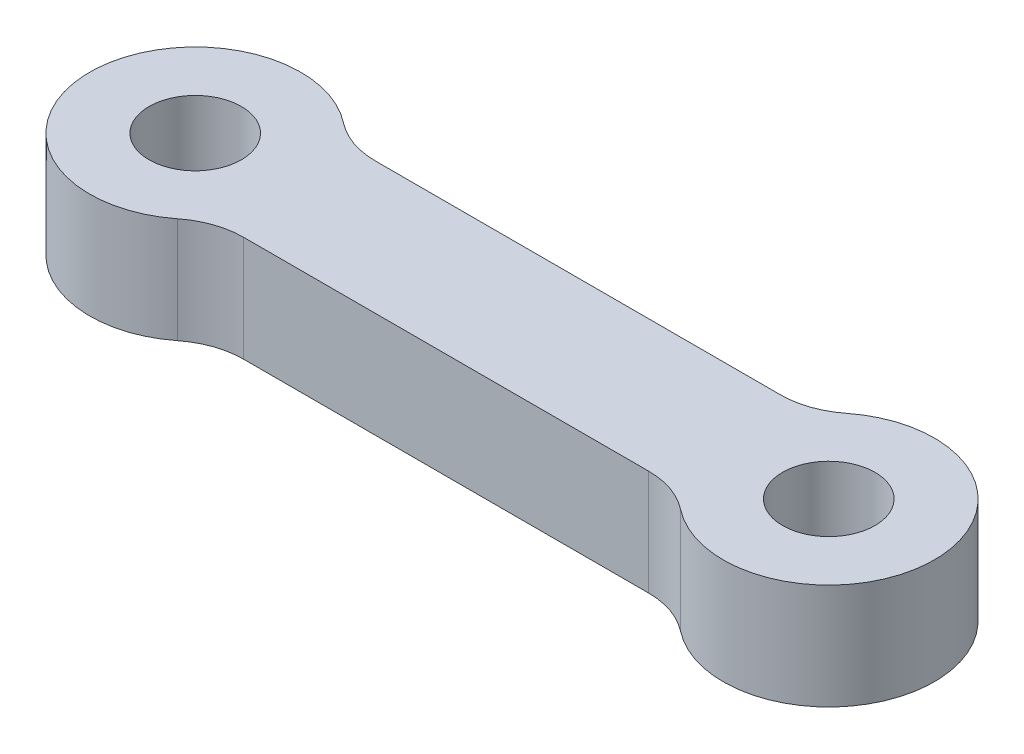
ISO-10303-21;
HEADER;
FILE_DESCRIPTION(('STEP AP214'),'2;1');
FILE_NAME('part.step','',(''),(''),'','','');
FILE_SCHEMA(('AUTOMOTIVE_DESIGN { 1 0 10303 214 1 1 1 1 }'));
ENDSEC;
DATA;
#1=APPLICATION_CONTEXT('core data for automotive mechanical design processes');
#2=APPLICATION_PROTOCOL_DEFINITION('international standard','automotive_design',2000,#1);
#3=PRODUCT_CONTEXT('',#1,'mechanical');
#4=PRODUCT('Part','Part','',(#3));
#5=PRODUCT_RELATED_PRODUCT_CATEGORY('part','',(#4));
#6=PRODUCT_DEFINITION_FORMATION('','',#4);
#7=PRODUCT_DEFINITION_CONTEXT('part definition',#1,'design');
#8=PRODUCT_DEFINITION('design','',#6,#7);
#9=PRODUCT_DEFINITION_SHAPE('','',#8);
#10=(LENGTH_UNIT() NAMED_UNIT(*) SI_UNIT(.MILLI.,.METRE.));
#11=(NAMED_UNIT(*) PLANE_ANGLE_UNIT() SI_UNIT($,.RADIAN.));
#12=(NAMED_UNIT(*) SI_UNIT($,.STERADIAN.) SOLID_ANGLE_UNIT());
#13=UNCERTAINTY_MEASURE_WITH_UNIT(LENGTH_MEASURE(1.E-05),#10,'distance_accuracy_value','');
#14=(GEOMETRIC_REPRESENTATION_CONTEXT(3) GLOBAL_UNCERTAINTY_ASSIGNED_CONTEXT((#13)) GLOBAL_UNIT_ASSIGNED_CONTEXT((#10,
#11,#12)) REPRESENTATION_CONTEXT('',''));
#15=CARTESIAN_POINT('',(0.,0.,0.));
#16=DIRECTION('',(0.,0.,1.));
#17=DIRECTION('',(1.,0.,0.));
#18=AXIS2_PLACEMENT_3D('',#15,#16,#17);
#19=CARTESIAN_POINT('',(24.,4.,0.));
#20=DIRECTION('',(0.,-1.,0.));
#21=DIRECTION('',(0.,0.,-1.));
#22=AXIS2_PLACEMENT_3D('',#19,#20,#21);
#23=CYLINDRICAL_SURFACE('',#22,4.00000000000001);
#24=CARTESIAN_POINT('',(24.,4.,0.));
#25=DIRECTION('',(0.,1.,0.));
#26=DIRECTION('',(0.,0.,1.));
#27=AXIS2_PLACEMENT_3D('',#24,#25,#26);
#28=CIRCLE('',#27,4.00000000000001);
#29=CARTESIAN_POINT('',(21.525641703473,4.,3.14285714285715));
#30=VERTEX_POINT('',#29);
#31=CARTESIAN_POINT('',(21.525641703473,4.,-3.14285714285715));
#32=VERTEX_POINT('',#31);
#33=EDGE_CURVE('E175',#30,#32,#28,.T.);
#34=ORIENTED_EDGE('',*,*,#33,.F.);
#35=DIRECTION('',(0.,-1.,0.));
#36=VECTOR('',#35,1.);
#37=CARTESIAN_POINT('',(21.525641703473,4.,3.14285714285715));
#38=LINE('',#37,#36);
#39=CARTESIAN_POINT('',(21.525641703473,0.,3.14285714285715));
#40=VERTEX_POINT('',#39);
#41=EDGE_CURVE('E226',#30,#40,#38,.T.);
#42=ORIENTED_EDGE('',*,*,#41,.T.);
#43=CARTESIAN_POINT('',(24.,0.,0.));
#44=DIRECTION('',(0.,1.,0.));
#45=DIRECTION('',(0.,0.,1.));
#46=AXIS2_PLACEMENT_3D('',#43,#44,#45);
#47=CIRCLE('',#46,4.00000000000001);
#48=CARTESIAN_POINT('',(21.525641703473,0.,-3.14285714285715));
#49=VERTEX_POINT('',#48);
#50=EDGE_CURVE('E191',#40,#49,#47,.T.);
#51=ORIENTED_EDGE('',*,*,#50,.T.);
#52=DIRECTION('',(0.,-1.,0.));
#53=VECTOR('',#52,1.);
#54=CARTESIAN_POINT('',(21.525641703473,4.,-3.14285714285715));
#55=LINE('',#54,#53);
#56=EDGE_CURVE('E217',#49,#32,#55,.F.);
#57=ORIENTED_EDGE('',*,*,#56,.T.);
#58=EDGE_LOOP('',(#34,#42,#51,#57));
#59=FACE_BOUND('',#58,.T.);
#60=ADVANCED_FACE('F41',(#59),#23,.T.);
#61=CARTESIAN_POINT('',(0.,4.,-2.5));
#62=DIRECTION('',(0.,0.,-1.));
#63=DIRECTION('',(-1.,0.,0.));
#64=AXIS2_PLACEMENT_3D('',#61,#62,#63);
#65=PLANE('',#64);
#66=DIRECTION('',(1.,0.,0.));
#67=VECTOR('',#66,1.);
#68=CARTESIAN_POINT('',(0.,4.,-2.5));
#69=LINE('',#68,#67);
#70=CARTESIAN_POINT('',(4.33012701892219,4.,-2.5));
#71=VERTEX_POINT('',#70);
#72=CARTESIAN_POINT('',(19.6698729810778,4.,-2.5));
#73=VERTEX_POINT('',#72);
#74=EDGE_CURVE('E202',#71,#73,#69,.T.);
#75=ORIENTED_EDGE('',*,*,#74,.T.);
#76=DIRECTION('',(0.,-1.,0.));
#77=VECTOR('',#76,1.);
#78=CARTESIAN_POINT('',(19.6698729810778,4.,-2.5));
#79=LINE('',#78,#77);
#80=CARTESIAN_POINT('',(19.6698729810778,0.,-2.5));
#81=VERTEX_POINT('',#80);
#82=EDGE_CURVE('E118',#73,#81,#79,.T.);
#83=ORIENTED_EDGE('',*,*,#82,.T.);
#84=DIRECTION('',(1.,0.,0.));
#85=VECTOR('',#84,1.);
#86=CARTESIAN_POINT('',(0.,0.,-2.5));
#87=LINE('',#86,#85);
#88=CARTESIAN_POINT('',(4.33012701892219,0.,-2.5));
#89=VERTEX_POINT('',#88);
#90=EDGE_CURVE('E141',#89,#81,#87,.T.);
#91=ORIENTED_EDGE('',*,*,#90,.F.);
#92=DIRECTION('',(0.,-1.,0.));
#93=VECTOR('',#92,1.);
#94=CARTESIAN_POINT('',(4.33012701892219,4.,-2.5));
#95=LINE('',#94,#93);
#96=EDGE_CURVE('E63',#89,#71,#95,.F.);
#97=ORIENTED_EDGE('',*,*,#96,.T.);
#98=EDGE_LOOP('',(#75,#83,#91,#97));
#99=FACE_BOUND('',#98,.T.);
#100=ADVANCED_FACE('F224',(#99),#65,.T.);
#101=CARTESIAN_POINT('',(0.,4.,0.));
#102=DIRECTION('',(0.,-1.,0.));
#103=DIRECTION('',(0.,0.,-1.));
#104=AXIS2_PLACEMENT_3D('',#101,#102,#103);
#105=CYLINDRICAL_SURFACE('',#104,4.);
#106=CARTESIAN_POINT('',(0.,0.,0.));
#107=DIRECTION('',(0.,1.,0.));
#108=DIRECTION('',(0.,0.,1.));
#109=AXIS2_PLACEMENT_3D('',#106,#107,#108);
#110=CIRCLE('',#109,4.);
#111=CARTESIAN_POINT('',(2.47435829652697,0.,-3.14285714285714));
#112=VERTEX_POINT('',#111);
#113=CARTESIAN_POINT('',(2.47435829652697,0.,3.14285714285714));
#114=VERTEX_POINT('',#113);
#115=EDGE_CURVE('E136',#112,#114,#110,.T.);
#116=ORIENTED_EDGE('',*,*,#115,.T.);
#117=DIRECTION('',(0.,-1.,0.));
#118=VECTOR('',#117,1.);
#119=CARTESIAN_POINT('',(2.47435829652697,4.,3.14285714285714));
#120=LINE('',#119,#118);
#121=CARTESIAN_POINT('',(2.47435829652697,4.,3.14285714285714));
#122=VERTEX_POINT('',#121);
#123=EDGE_CURVE('E112',#114,#122,#120,.F.);
#124=ORIENTED_EDGE('',*,*,#123,.T.);
#125=CARTESIAN_POINT('',(0.,4.,0.));
#126=DIRECTION('',(0.,1.,0.));
#127=DIRECTION('',(0.,0.,1.));
#128=AXIS2_PLACEMENT_3D('',#125,#126,#127);
#129=CIRCLE('',#128,4.);
#130=CARTESIAN_POINT('',(2.47435829652697,4.,-3.14285714285714));
#131=VERTEX_POINT('',#130);
#132=EDGE_CURVE('E183',#131,#122,#129,.T.);
#133=ORIENTED_EDGE('',*,*,#132,.F.);
#134=DIRECTION('',(0.,-1.,0.));
#135=VECTOR('',#134,1.);
#136=CARTESIAN_POINT('',(2.47435829652697,4.,-3.14285714285714));
#137=LINE('',#136,#135);
#138=EDGE_CURVE('E128',#131,#112,#137,.T.);
#139=ORIENTED_EDGE('',*,*,#138,.T.);
#140=EDGE_LOOP('',(#116,#124,#133,#139));
#141=FACE_BOUND('',#140,.T.);
#142=ADVANCED_FACE('F235',(#141),#105,.T.);
#143=CARTESIAN_POINT('',(0.,4.,0.));
#144=DIRECTION('',(0.,-1.,0.));
#145=DIRECTION('',(0.,0.,-1.));
#146=AXIS2_PLACEMENT_3D('',#143,#144,#145);
#147=CYLINDRICAL_SURFACE('',#146,1.75);
#148=CARTESIAN_POINT('',(0.,4.,0.));
#149=DIRECTION('',(0.,1.,0.));
#150=DIRECTION('',(0.,0.,1.));
#151=AXIS2_PLACEMENT_3D('',#148,#149,#150);
#152=CIRCLE('',#151,1.75);
#153=CARTESIAN_POINT('',(0.,4.,1.75));
#154=VERTEX_POINT('',#153);
#155=EDGE_CURVE('E182',#154,#154,#152,.T.);
#156=ORIENTED_EDGE('',*,*,#155,.T.);
#157=EDGE_LOOP('',(#156));
#158=FACE_BOUND('',#157,.T.);
#159=CARTESIAN_POINT('',(0.,0.,0.));
#160=DIRECTION('',(0.,1.,0.));
#161=DIRECTION('',(0.,0.,1.));
#162=AXIS2_PLACEMENT_3D('',#159,#160,#161);
#163=CIRCLE('',#162,1.75);
#164=CARTESIAN_POINT('',(0.,0.,1.75));
#165=VERTEX_POINT('',#164);
#166=EDGE_CURVE('E135',#165,#165,#163,.T.);
#167=ORIENTED_EDGE('',*,*,#166,.F.);
#168=EDGE_LOOP('',(#167));
#169=FACE_BOUND('',#168,.T.);
#170=ADVANCED_FACE('F302',(#158,#169),#147,.F.);
#171=CARTESIAN_POINT('',(0.,4.,2.5));
#172=DIRECTION('',(0.,0.,-1.));
#173=DIRECTION('',(-1.,0.,0.));
#174=AXIS2_PLACEMENT_3D('',#171,#172,#173);
#175=PLANE('',#174);
#176=DIRECTION('',(1.,0.,0.));
#177=VECTOR('',#176,1.);
#178=CARTESIAN_POINT('',(0.,4.,2.5));
#179=LINE('',#178,#177);
#180=CARTESIAN_POINT('',(4.3301270189222,4.,2.5));
#181=VERTEX_POINT('',#180);
#182=CARTESIAN_POINT('',(19.6698729810778,4.,2.5));
#183=VERTEX_POINT('',#182);
#184=EDGE_CURVE('E127',#181,#183,#179,.T.);
#185=ORIENTED_EDGE('',*,*,#184,.F.);
#186=DIRECTION('',(0.,1.,0.));
#187=VECTOR('',#186,1.);
#188=CARTESIAN_POINT('',(4.3301270189222,0.,2.5));
#189=LINE('',#188,#187);
#190=CARTESIAN_POINT('',(4.3301270189222,0.,2.5));
#191=VERTEX_POINT('',#190);
#192=EDGE_CURVE('E111',#181,#191,#189,.F.);
#193=ORIENTED_EDGE('',*,*,#192,.T.);
#194=DIRECTION('',(1.,0.,0.));
#195=VECTOR('',#194,1.);
#196=CARTESIAN_POINT('',(0.,0.,2.5));
#197=LINE('',#196,#195);
#198=CARTESIAN_POINT('',(19.6698729810778,0.,2.5));
#199=VERTEX_POINT('',#198);
#200=EDGE_CURVE('E124',#191,#199,#197,.T.);
#201=ORIENTED_EDGE('',*,*,#200,.T.);
#202=DIRECTION('',(0.,1.,0.));
#203=VECTOR('',#202,1.);
#204=CARTESIAN_POINT('',(19.6698729810778,4.,2.5));
#205=LINE('',#204,#203);
#206=EDGE_CURVE('E129',#199,#183,#205,.T.);
#207=ORIENTED_EDGE('',*,*,#206,.T.);
#208=EDGE_LOOP('',(#185,#193,#201,#207));
#209=FACE_BOUND('',#208,.T.);
#210=ADVANCED_FACE('F123',(#209),#175,.F.);
#211=CARTESIAN_POINT('',(24.,4.,0.));
#212=DIRECTION('',(0.,-1.,0.));
#213=DIRECTION('',(0.,0.,-1.));
#214=AXIS2_PLACEMENT_3D('',#211,#212,#213);
#215=CYLINDRICAL_SURFACE('',#214,1.75);
#216=CARTESIAN_POINT('',(24.,4.,0.));
#217=DIRECTION('',(0.,1.,0.));
#218=DIRECTION('',(0.,0.,1.));
#219=AXIS2_PLACEMENT_3D('',#216,#217,#218);
#220=CIRCLE('',#219,1.75);
#221=CARTESIAN_POINT('',(24.,4.,1.75));
#222=VERTEX_POINT('',#221);
#223=EDGE_CURVE('E177',#222,#222,#220,.T.);
#224=ORIENTED_EDGE('',*,*,#223,.T.);
#225=EDGE_LOOP('',(#224));
#226=FACE_BOUND('',#225,.T.);
#227=CARTESIAN_POINT('',(24.,0.,0.));
#228=DIRECTION('',(0.,1.,0.));
#229=DIRECTION('',(0.,0.,1.));
#230=AXIS2_PLACEMENT_3D('',#227,#228,#229);
#231=CIRCLE('',#230,1.75);
#232=CARTESIAN_POINT('',(24.,0.,1.75));
#233=VERTEX_POINT('',#232);
#234=EDGE_CURVE('E139',#233,#233,#231,.T.);
#235=ORIENTED_EDGE('',*,*,#234,.F.);
#236=EDGE_LOOP('',(#235));
#237=FACE_BOUND('',#236,.T.);
#238=ADVANCED_FACE('F290',(#226,#237),#215,.F.);
#239=CARTESIAN_POINT('',(0.,4.,0.));
#240=DIRECTION('',(0.,1.,0.));
#241=DIRECTION('',(0.,0.,1.));
#242=AXIS2_PLACEMENT_3D('',#239,#240,#241);
#243=PLANE('',#242);
#244=ORIENTED_EDGE('',*,*,#184,.T.);
#245=CARTESIAN_POINT('',(19.6698729810778,4.,5.5));
#246=DIRECTION('',(0.,1.,0.));
#247=DIRECTION('',(0.,0.,1.));
#248=AXIS2_PLACEMENT_3D('',#245,#246,#247);
#249=CIRCLE('',#248,3.);
#250=EDGE_CURVE('E162',#183,#30,#249,.F.);
#251=ORIENTED_EDGE('',*,*,#250,.T.);
#252=ORIENTED_EDGE('',*,*,#33,.T.);
#253=CARTESIAN_POINT('',(19.6698729810778,4.,-5.5));
#254=DIRECTION('',(0.,1.,0.));
#255=DIRECTION('',(0.,0.,1.));
#256=AXIS2_PLACEMENT_3D('',#253,#254,#255);
#257=CIRCLE('',#256,3.);
#258=EDGE_CURVE('E56',#32,#73,#257,.F.);
#259=ORIENTED_EDGE('',*,*,#258,.T.);
#260=ORIENTED_EDGE('',*,*,#74,.F.);
#261=CARTESIAN_POINT('',(4.33012701892219,4.,-5.5));
#262=DIRECTION('',(0.,1.,0.));
#263=DIRECTION('',(0.,0.,1.));
#264=AXIS2_PLACEMENT_3D('',#261,#262,#263);
#265=CIRCLE('',#264,3.);
#266=EDGE_CURVE('E12',#71,#131,#265,.F.);
#267=ORIENTED_EDGE('',*,*,#266,.T.);
#268=ORIENTED_EDGE('',*,*,#132,.T.);
#269=CARTESIAN_POINT('',(4.3301270189222,4.,5.5));
#270=DIRECTION('',(0.,1.,0.));
#271=DIRECTION('',(0.,0.,1.));
#272=AXIS2_PLACEMENT_3D('',#269,#270,#271);
#273=CIRCLE('',#272,3.);
#274=EDGE_CURVE('E117',#122,#181,#273,.F.);
#275=ORIENTED_EDGE('',*,*,#274,.T.);
#276=EDGE_LOOP('',(#244,#251,#252,#259,#260,#267,#268,#275));
#277=FACE_BOUND('',#276,.T.);
#278=ORIENTED_EDGE('',*,*,#155,.F.);
#279=EDGE_LOOP('',(#278));
#280=FACE_BOUND('',#279,.T.);
#281=ORIENTED_EDGE('',*,*,#223,.F.);
#282=EDGE_LOOP('',(#281));
#283=FACE_BOUND('',#282,.T.);
#284=ADVANCED_FACE('F207',(#277,#280,#283),#243,.T.);
#285=CARTESIAN_POINT('',(0.,0.,0.));
#286=DIRECTION('',(0.,1.,0.));
#287=DIRECTION('',(0.,0.,1.));
#288=AXIS2_PLACEMENT_3D('',#285,#286,#287);
#289=PLANE('',#288);
#290=ORIENTED_EDGE('',*,*,#50,.F.);
#291=CARTESIAN_POINT('',(19.6698729810778,0.,5.5));
#292=DIRECTION('',(0.,1.,0.));
#293=DIRECTION('',(0.,0.,1.));
#294=AXIS2_PLACEMENT_3D('',#291,#292,#293);
#295=CIRCLE('',#294,3.);
#296=EDGE_CURVE('E134',#40,#199,#295,.T.);
#297=ORIENTED_EDGE('',*,*,#296,.T.);
#298=ORIENTED_EDGE('',*,*,#200,.F.);
#299=CARTESIAN_POINT('',(4.3301270189222,0.,5.5));
#300=DIRECTION('',(0.,1.,0.));
#301=DIRECTION('',(0.,0.,1.));
#302=AXIS2_PLACEMENT_3D('',#299,#300,#301);
#303=CIRCLE('',#302,3.);
#304=EDGE_CURVE('E107',#191,#114,#303,.T.);
#305=ORIENTED_EDGE('',*,*,#304,.T.);
#306=ORIENTED_EDGE('',*,*,#115,.F.);
#307=CARTESIAN_POINT('',(4.33012701892219,0.,-5.5));
#308=DIRECTION('',(0.,1.,0.));
#309=DIRECTION('',(0.,0.,1.));
#310=AXIS2_PLACEMENT_3D('',#307,#308,#309);
#311=CIRCLE('',#310,3.);
#312=EDGE_CURVE('E49',#112,#89,#311,.T.);
#313=ORIENTED_EDGE('',*,*,#312,.T.);
#314=ORIENTED_EDGE('',*,*,#90,.T.);
#315=CARTESIAN_POINT('',(19.6698729810778,0.,-5.5));
#316=DIRECTION('',(0.,1.,0.));
#317=DIRECTION('',(0.,0.,1.));
#318=AXIS2_PLACEMENT_3D('',#315,#316,#317);
#319=CIRCLE('',#318,3.);
#320=EDGE_CURVE('E164',#81,#49,#319,.T.);
#321=ORIENTED_EDGE('',*,*,#320,.T.);
#322=EDGE_LOOP('',(#290,#297,#298,#305,#306,#313,#314,#321));
#323=FACE_BOUND('',#322,.T.);
#324=ORIENTED_EDGE('',*,*,#166,.T.);
#325=EDGE_LOOP('',(#324));
#326=FACE_BOUND('',#325,.T.);
#327=ORIENTED_EDGE('',*,*,#234,.T.);
#328=EDGE_LOOP('',(#327));
#329=FACE_BOUND('',#328,.T.);
#330=ADVANCED_FACE('F132',(#323,#326,#329),#289,.F.);
#331=CARTESIAN_POINT('',(4.3301270189222,4.,5.5));
#332=DIRECTION('',(0.,-1.,0.));
#333=DIRECTION('',(0.,0.,-1.));
#334=AXIS2_PLACEMENT_3D('',#331,#332,#333);
#335=CYLINDRICAL_SURFACE('',#334,3.);
#336=ORIENTED_EDGE('',*,*,#274,.F.);
#337=ORIENTED_EDGE('',*,*,#123,.F.);
#338=ORIENTED_EDGE('',*,*,#304,.F.);
#339=ORIENTED_EDGE('',*,*,#192,.F.);
#340=EDGE_LOOP('',(#336,#337,#338,#339));
#341=FACE_BOUND('',#340,.T.);
#342=ADVANCED_FACE('F110',(#341),#335,.F.);
#343=CARTESIAN_POINT('',(19.6698729810778,4.,5.5));
#344=DIRECTION('',(0.,-1.,0.));
#345=DIRECTION('',(0.,0.,-1.));
#346=AXIS2_PLACEMENT_3D('',#343,#344,#345);
#347=CYLINDRICAL_SURFACE('',#346,3.);
#348=ORIENTED_EDGE('',*,*,#250,.F.);
#349=ORIENTED_EDGE('',*,*,#206,.F.);
#350=ORIENTED_EDGE('',*,*,#296,.F.);
#351=ORIENTED_EDGE('',*,*,#41,.F.);
#352=EDGE_LOOP('',(#348,#349,#350,#351));
#353=FACE_BOUND('',#352,.T.);
#354=ADVANCED_FACE('F238',(#353),#347,.F.);
#355=CARTESIAN_POINT('',(19.6698729810778,4.,-5.5));
#356=DIRECTION('',(0.,-1.,0.));
#357=DIRECTION('',(0.,0.,-1.));
#358=AXIS2_PLACEMENT_3D('',#355,#356,#357);
#359=CYLINDRICAL_SURFACE('',#358,3.);
#360=ORIENTED_EDGE('',*,*,#258,.F.);
#361=ORIENTED_EDGE('',*,*,#56,.F.);
#362=ORIENTED_EDGE('',*,*,#320,.F.);
#363=ORIENTED_EDGE('',*,*,#82,.F.);
#364=EDGE_LOOP('',(#360,#361,#362,#363));
#365=FACE_BOUND('',#364,.T.);
#366=ADVANCED_FACE('F216',(#365),#359,.F.);
#367=CARTESIAN_POINT('',(4.33012701892219,4.,-5.5));
#368=DIRECTION('',(0.,-1.,0.));
#369=DIRECTION('',(0.,0.,-1.));
#370=AXIS2_PLACEMENT_3D('',#367,#368,#369);
#371=CYLINDRICAL_SURFACE('',#370,3.);
#372=ORIENTED_EDGE('',*,*,#266,.F.);
#373=ORIENTED_EDGE('',*,*,#96,.F.);
#374=ORIENTED_EDGE('',*,*,#312,.F.);
#375=ORIENTED_EDGE('',*,*,#138,.F.);
#376=EDGE_LOOP('',(#372,#373,#374,#375));
#377=FACE_BOUND('',#376,.T.);
#378=ADVANCED_FACE('F43',(#377),#371,.F.);
#379=CLOSED_SHELL('',(#60,#100,#142,#170,#210,#238,#284,#330,#342,#354,#366,#378));
#380=MANIFOLD_SOLID_BREP('B2',#379);
#381=ADVANCED_BREP_SHAPE_REPRESENTATION('',(#18,#380),#14);
#382=SHAPE_DEFINITION_REPRESENTATION(#9,#381);
ENDSEC;
END-ISO-10303-21;
